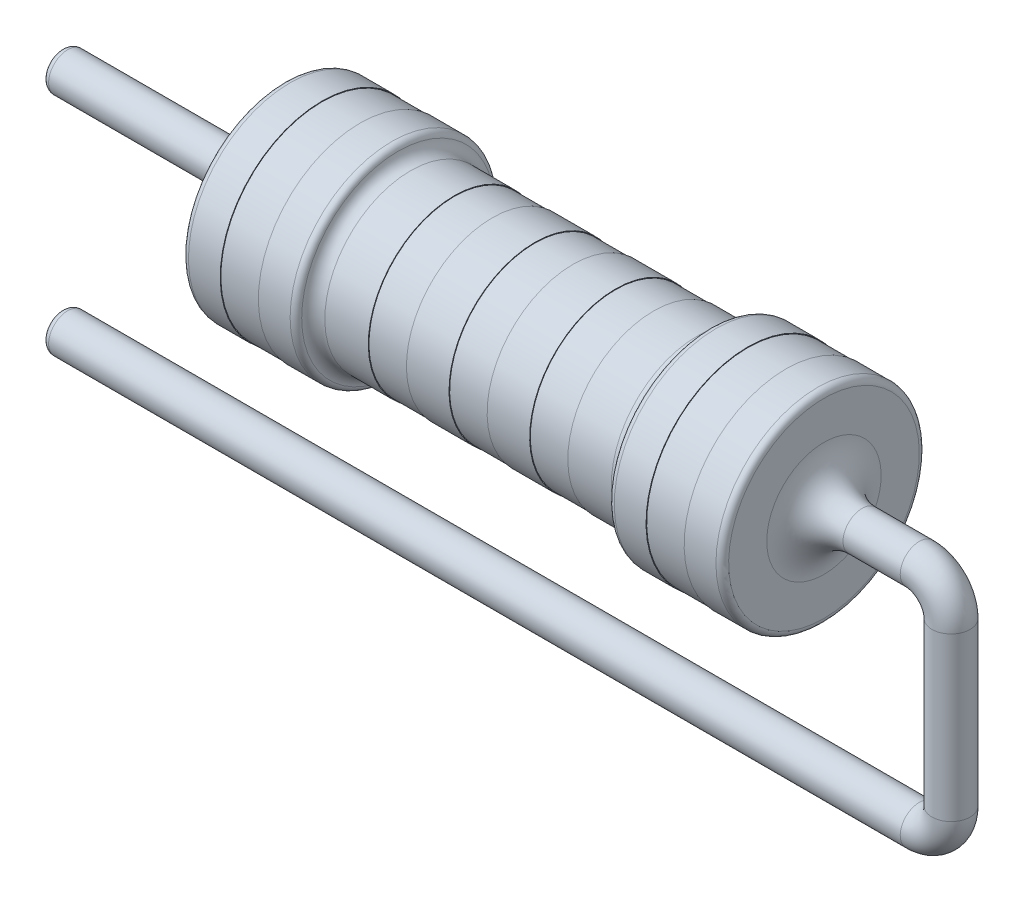
ISO-10303-21;
HEADER;
FILE_DESCRIPTION(('STEP AP214'),'2;1');
FILE_NAME('part.step','',(''),(''),'','','');
FILE_SCHEMA(('AUTOMOTIVE_DESIGN { 1 0 10303 214 1 1 1 1 }'));
ENDSEC;
DATA;
#1=APPLICATION_CONTEXT('core data for automotive mechanical design processes');
#2=APPLICATION_PROTOCOL_DEFINITION('international standard','automotive_design',2000,#1);
#3=PRODUCT_CONTEXT('',#1,'mechanical');
#4=PRODUCT('Part','Part','',(#3));
#5=PRODUCT_RELATED_PRODUCT_CATEGORY('part','',(#4));
#6=PRODUCT_DEFINITION_FORMATION('','',#4);
#7=PRODUCT_DEFINITION_CONTEXT('part definition',#1,'design');
#8=PRODUCT_DEFINITION('design','',#6,#7);
#9=PRODUCT_DEFINITION_SHAPE('','',#8);
#10=(LENGTH_UNIT() NAMED_UNIT(*) SI_UNIT(.MILLI.,.METRE.));
#11=(NAMED_UNIT(*) PLANE_ANGLE_UNIT() SI_UNIT($,.RADIAN.));
#12=(NAMED_UNIT(*) SI_UNIT($,.STERADIAN.) SOLID_ANGLE_UNIT());
#13=UNCERTAINTY_MEASURE_WITH_UNIT(LENGTH_MEASURE(1.E-05),#10,'distance_accuracy_value','');
#14=(GEOMETRIC_REPRESENTATION_CONTEXT(3) GLOBAL_UNCERTAINTY_ASSIGNED_CONTEXT((#13)) GLOBAL_UNIT_ASSIGNED_CONTEXT((#10,
#11,#12)) REPRESENTATION_CONTEXT('',''));
#15=CARTESIAN_POINT('',(0.,0.,0.));
#16=DIRECTION('',(0.,0.,1.));
#17=DIRECTION('',(1.,0.,0.));
#18=AXIS2_PLACEMENT_3D('',#15,#16,#17);
#19=CARTESIAN_POINT('',(-4.25,0.,0.));
#20=DIRECTION('',(1.,0.,0.));
#21=DIRECTION('',(0.,1.,0.));
#22=AXIS2_PLACEMENT_3D('',#19,#20,#21);
#23=PLANE('',#22);
#24=CARTESIAN_POINT('',(-4.25,0.,0.));
#25=DIRECTION('',(1.,0.,0.));
#26=DIRECTION('',(0.,1.,0.));
#27=AXIS2_PLACEMENT_3D('',#24,#25,#26);
#28=CIRCLE('',#27,0.9);
#29=CARTESIAN_POINT('',(-4.25,0.899999999999981,0.));
#30=VERTEX_POINT('',#29);
#31=EDGE_CURVE('E50',#30,#30,#28,.T.);
#32=ORIENTED_EDGE('',*,*,#31,.T.);
#33=EDGE_LOOP('',(#32));
#34=FACE_BOUND('',#33,.T.);
#35=CARTESIAN_POINT('',(-4.25,0.,0.));
#36=DIRECTION('',(1.,0.,0.));
#37=DIRECTION('',(0.,1.,0.));
#38=AXIS2_PLACEMENT_3D('',#35,#36,#37);
#39=CIRCLE('',#38,1.5);
#40=CARTESIAN_POINT('',(-4.25000000000001,1.49999999999994,0.));
#41=VERTEX_POINT('',#40);
#42=EDGE_CURVE('E94',#41,#41,#39,.F.);
#43=ORIENTED_EDGE('',*,*,#42,.T.);
#44=EDGE_LOOP('',(#43));
#45=FACE_BOUND('',#44,.T.);
#46=ADVANCED_FACE('F36',(#34,#45),#23,.F.);
#47=CARTESIAN_POINT('',(4.25,0.,0.));
#48=DIRECTION('',(-1.,0.,0.));
#49=DIRECTION('',(0.,-1.,0.));
#50=AXIS2_PLACEMENT_3D('',#47,#48,#49);
#51=PLANE('',#50);
#52=CARTESIAN_POINT('',(4.25,0.,0.));
#53=DIRECTION('',(-1.,0.,0.));
#54=DIRECTION('',(0.,-1.,0.));
#55=AXIS2_PLACEMENT_3D('',#52,#53,#54);
#56=CIRCLE('',#55,0.9);
#57=CARTESIAN_POINT('',(4.25,-0.899999999999984,0.));
#58=VERTEX_POINT('',#57);
#59=EDGE_CURVE('E10',#58,#58,#56,.T.);
#60=ORIENTED_EDGE('',*,*,#59,.T.);
#61=EDGE_LOOP('',(#60));
#62=FACE_BOUND('',#61,.T.);
#63=CARTESIAN_POINT('',(4.25,0.,0.));
#64=DIRECTION('',(-1.,0.,0.));
#65=DIRECTION('',(0.,-1.,0.));
#66=AXIS2_PLACEMENT_3D('',#63,#64,#65);
#67=CIRCLE('',#66,1.5);
#68=CARTESIAN_POINT('',(4.25000000000001,-1.5,0.));
#69=VERTEX_POINT('',#68);
#70=EDGE_CURVE('E106',#69,#69,#67,.F.);
#71=ORIENTED_EDGE('',*,*,#70,.T.);
#72=EDGE_LOOP('',(#71));
#73=FACE_BOUND('',#72,.T.);
#74=ADVANCED_FACE('F230',(#62,#73),#51,.F.);
#75=CARTESIAN_POINT('',(4.25,0.,0.));
#76=DIRECTION('',(1.,0.,0.));
#77=DIRECTION('',(0.,1.,0.));
#78=AXIS2_PLACEMENT_3D('',#75,#76,#77);
#79=CYLINDRICAL_SURFACE('',#78,1.33999999999997);
#80=CARTESIAN_POINT('',(0.299999999999991,0.,0.));
#81=DIRECTION('',(1.,0.,0.));
#82=DIRECTION('',(0.,1.,0.));
#83=AXIS2_PLACEMENT_3D('',#80,#81,#82);
#84=CIRCLE('',#83,1.33999999999997);
#85=CARTESIAN_POINT('',(0.299999999999982,1.33999999999995,0.));
#86=VERTEX_POINT('',#85);
#87=EDGE_CURVE('E193',#86,#86,#84,.T.);
#88=ORIENTED_EDGE('',*,*,#87,.F.);
#89=EDGE_LOOP('',(#88));
#90=FACE_BOUND('',#89,.T.);
#91=CARTESIAN_POINT('',(-0.299999999999991,0.,0.));
#92=DIRECTION('',(1.,0.,0.));
#93=DIRECTION('',(0.,1.,0.));
#94=AXIS2_PLACEMENT_3D('',#91,#92,#93);
#95=CIRCLE('',#94,1.33999999999997);
#96=CARTESIAN_POINT('',(-0.3,1.33999999999994,0.));
#97=VERTEX_POINT('',#96);
#98=EDGE_CURVE('E118',#97,#97,#95,.T.);
#99=ORIENTED_EDGE('',*,*,#98,.T.);
#100=EDGE_LOOP('',(#99));
#101=FACE_BOUND('',#100,.T.);
#102=ADVANCED_FACE('F236',(#90,#101),#79,.T.);
#103=CARTESIAN_POINT('',(-0.299999999999982,-1.34,0.));
#104=DIRECTION('',(-1.,0.,0.));
#105=DIRECTION('',(0.,-1.,0.));
#106=AXIS2_PLACEMENT_3D('',#103,#104,#105);
#107=PLANE('',#106);
#108=ORIENTED_EDGE('',*,*,#98,.F.);
#109=EDGE_LOOP('',(#108));
#110=FACE_BOUND('',#109,.T.);
#111=CARTESIAN_POINT('',(-0.299999999999991,0.,0.));
#112=DIRECTION('',(1.,0.,0.));
#113=DIRECTION('',(0.,1.,0.));
#114=AXIS2_PLACEMENT_3D('',#111,#112,#113);
#115=CIRCLE('',#114,1.34999999999997);
#116=CARTESIAN_POINT('',(-0.3,1.34999999999994,0.));
#117=VERTEX_POINT('',#116);
#118=EDGE_CURVE('E122',#117,#117,#115,.T.);
#119=ORIENTED_EDGE('',*,*,#118,.T.);
#120=EDGE_LOOP('',(#119));
#121=FACE_BOUND('',#120,.T.);
#122=ADVANCED_FACE('F281',(#110,#121),#107,.F.);
#123=CARTESIAN_POINT('',(4.25,0.,0.));
#124=DIRECTION('',(1.,0.,0.));
#125=DIRECTION('',(0.,1.,0.));
#126=AXIS2_PLACEMENT_3D('',#123,#124,#125);
#127=CYLINDRICAL_SURFACE('',#126,1.34999999999998);
#128=ORIENTED_EDGE('',*,*,#118,.F.);
#129=EDGE_LOOP('',(#128));
#130=FACE_BOUND('',#129,.T.);
#131=CARTESIAN_POINT('',(-0.969520407326291,0.,0.));
#132=DIRECTION('',(1.,0.,0.));
#133=DIRECTION('',(0.,1.,0.));
#134=AXIS2_PLACEMENT_3D('',#131,#132,#133);
#135=CIRCLE('',#134,1.34999999999998);
#136=CARTESIAN_POINT('',(-0.9695204073263,1.34999999999994,0.));
#137=VERTEX_POINT('',#136);
#138=EDGE_CURVE('E126',#137,#137,#135,.T.);
#139=ORIENTED_EDGE('',*,*,#138,.T.);
#140=EDGE_LOOP('',(#139));
#141=FACE_BOUND('',#140,.T.);
#142=ADVANCED_FACE('F277',(#130,#141),#127,.T.);
#143=CARTESIAN_POINT('',(-0.969520407326283,-1.34000000000001,0.));
#144=DIRECTION('',(1.,0.,0.));
#145=DIRECTION('',(0.,1.,0.));
#146=AXIS2_PLACEMENT_3D('',#143,#144,#145);
#147=PLANE('',#146);
#148=ORIENTED_EDGE('',*,*,#138,.F.);
#149=EDGE_LOOP('',(#148));
#150=FACE_BOUND('',#149,.T.);
#151=CARTESIAN_POINT('',(-0.969520407326291,0.,0.));
#152=DIRECTION('',(1.,0.,0.));
#153=DIRECTION('',(0.,1.,0.));
#154=AXIS2_PLACEMENT_3D('',#151,#152,#153);
#155=CIRCLE('',#154,1.33999999999998);
#156=CARTESIAN_POINT('',(-0.9695204073263,1.33999999999994,0.));
#157=VERTEX_POINT('',#156);
#158=EDGE_CURVE('E130',#157,#157,#155,.T.);
#159=ORIENTED_EDGE('',*,*,#158,.T.);
#160=EDGE_LOOP('',(#159));
#161=FACE_BOUND('',#160,.T.);
#162=ADVANCED_FACE('F273',(#150,#161),#147,.F.);
#163=CARTESIAN_POINT('',(4.25,0.,0.));
#164=DIRECTION('',(1.,0.,0.));
#165=DIRECTION('',(0.,1.,0.));
#166=AXIS2_PLACEMENT_3D('',#163,#164,#165);
#167=CYLINDRICAL_SURFACE('',#166,1.33999999999998);
#168=ORIENTED_EDGE('',*,*,#158,.F.);
#169=EDGE_LOOP('',(#168));
#170=FACE_BOUND('',#169,.T.);
#171=CARTESIAN_POINT('',(-1.56952040732629,0.,0.));
#172=DIRECTION('',(1.,0.,0.));
#173=DIRECTION('',(0.,1.,0.));
#174=AXIS2_PLACEMENT_3D('',#171,#172,#173);
#175=CIRCLE('',#174,1.33999999999998);
#176=CARTESIAN_POINT('',(-1.5695204073263,1.33999999999994,0.));
#177=VERTEX_POINT('',#176);
#178=EDGE_CURVE('E134',#177,#177,#175,.T.);
#179=ORIENTED_EDGE('',*,*,#178,.T.);
#180=EDGE_LOOP('',(#179));
#181=FACE_BOUND('',#180,.T.);
#182=ADVANCED_FACE('F269',(#170,#181),#167,.T.);
#183=CARTESIAN_POINT('',(-1.56952040732628,-1.35000000000002,0.));
#184=DIRECTION('',(-1.,0.,0.));
#185=DIRECTION('',(0.,-1.,0.));
#186=AXIS2_PLACEMENT_3D('',#183,#184,#185);
#187=PLANE('',#186);
#188=ORIENTED_EDGE('',*,*,#178,.F.);
#189=EDGE_LOOP('',(#188));
#190=FACE_BOUND('',#189,.T.);
#191=CARTESIAN_POINT('',(-1.56952040732629,0.,0.));
#192=DIRECTION('',(1.,0.,0.));
#193=DIRECTION('',(0.,1.,0.));
#194=AXIS2_PLACEMENT_3D('',#191,#192,#193);
#195=CIRCLE('',#194,1.34999999999998);
#196=CARTESIAN_POINT('',(-1.5695204073263,1.34999999999994,0.));
#197=VERTEX_POINT('',#196);
#198=EDGE_CURVE('E138',#197,#197,#195,.T.);
#199=ORIENTED_EDGE('',*,*,#198,.T.);
#200=EDGE_LOOP('',(#199));
#201=FACE_BOUND('',#200,.T.);
#202=ADVANCED_FACE('F265',(#190,#201),#187,.F.);
#203=CARTESIAN_POINT('',(4.25,0.,0.));
#204=DIRECTION('',(1.,0.,0.));
#205=DIRECTION('',(0.,1.,0.));
#206=AXIS2_PLACEMENT_3D('',#203,#204,#205);
#207=CYLINDRICAL_SURFACE('',#206,1.34999999999999);
#208=CARTESIAN_POINT('',(-2.25419601084501,0.,0.));
#209=DIRECTION('',(1.,0.,0.));
#210=DIRECTION('',(0.,1.,0.));
#211=AXIS2_PLACEMENT_3D('',#208,#209,#210);
#212=CIRCLE('',#211,1.34999999999999);
#213=CARTESIAN_POINT('',(-2.25419601084502,1.34999999999994,0.));
#214=VERTEX_POINT('',#213);
#215=EDGE_CURVE('E82',#214,#214,#212,.T.);
#216=ORIENTED_EDGE('',*,*,#215,.T.);
#217=EDGE_LOOP('',(#216));
#218=FACE_BOUND('',#217,.T.);
#219=ORIENTED_EDGE('',*,*,#198,.F.);
#220=EDGE_LOOP('',(#219));
#221=FACE_BOUND('',#220,.T.);
#222=ADVANCED_FACE('F261',(#218,#221),#207,.T.);
#223=CARTESIAN_POINT('',(4.25,0.,0.));
#224=DIRECTION('',(1.,0.,0.));
#225=DIRECTION('',(0.,1.,0.));
#226=AXIS2_PLACEMENT_3D('',#223,#224,#225);
#227=CYLINDRICAL_SURFACE('',#226,1.59999999999999);
#228=CARTESIAN_POINT('',(-2.54999999999999,0.,0.));
#229=DIRECTION('',(-1.,0.,0.));
#230=DIRECTION('',(0.,-1.,0.));
#231=AXIS2_PLACEMENT_3D('',#228,#229,#230);
#232=CIRCLE('',#231,1.59999999999999);
#233=CARTESIAN_POINT('',(-2.54999999999998,-1.60000000000003,0.));
#234=VERTEX_POINT('',#233);
#235=EDGE_CURVE('E110',#234,#234,#232,.T.);
#236=ORIENTED_EDGE('',*,*,#235,.T.);
#237=EDGE_LOOP('',(#236));
#238=FACE_BOUND('',#237,.T.);
#239=CARTESIAN_POINT('',(-3.04999999999999,0.,0.));
#240=DIRECTION('',(1.,0.,0.));
#241=DIRECTION('',(0.,1.,0.));
#242=AXIS2_PLACEMENT_3D('',#239,#240,#241);
#243=CIRCLE('',#242,1.59999999999999);
#244=CARTESIAN_POINT('',(-3.05,1.59999999999994,0.));
#245=VERTEX_POINT('',#244);
#246=EDGE_CURVE('E142',#245,#245,#243,.T.);
#247=ORIENTED_EDGE('',*,*,#246,.T.);
#248=EDGE_LOOP('',(#247));
#249=FACE_BOUND('',#248,.T.);
#250=ADVANCED_FACE('F257',(#238,#249),#227,.T.);
#251=CARTESIAN_POINT('',(-3.04999999999998,-1.59000000000004,0.));
#252=DIRECTION('',(1.,0.,0.));
#253=DIRECTION('',(0.,1.,0.));
#254=AXIS2_PLACEMENT_3D('',#251,#252,#253);
#255=PLANE('',#254);
#256=ORIENTED_EDGE('',*,*,#246,.F.);
#257=EDGE_LOOP('',(#256));
#258=FACE_BOUND('',#257,.T.);
#259=CARTESIAN_POINT('',(-3.04999999999999,0.,0.));
#260=DIRECTION('',(1.,0.,0.));
#261=DIRECTION('',(0.,1.,0.));
#262=AXIS2_PLACEMENT_3D('',#259,#260,#261);
#263=CIRCLE('',#262,1.58999999999999);
#264=CARTESIAN_POINT('',(-3.05,1.58999999999994,0.));
#265=VERTEX_POINT('',#264);
#266=EDGE_CURVE('E146',#265,#265,#263,.T.);
#267=ORIENTED_EDGE('',*,*,#266,.T.);
#268=EDGE_LOOP('',(#267));
#269=FACE_BOUND('',#268,.T.);
#270=ADVANCED_FACE('F253',(#258,#269),#255,.F.);
#271=CARTESIAN_POINT('',(4.25,0.,0.));
#272=DIRECTION('',(1.,0.,0.));
#273=DIRECTION('',(0.,1.,0.));
#274=AXIS2_PLACEMENT_3D('',#271,#272,#273);
#275=CYLINDRICAL_SURFACE('',#274,1.58999999999999);
#276=ORIENTED_EDGE('',*,*,#266,.F.);
#277=EDGE_LOOP('',(#276));
#278=FACE_BOUND('',#277,.T.);
#279=CARTESIAN_POINT('',(-3.64999999999999,0.,0.));
#280=DIRECTION('',(1.,0.,0.));
#281=DIRECTION('',(0.,1.,0.));
#282=AXIS2_PLACEMENT_3D('',#279,#280,#281);
#283=CIRCLE('',#282,1.59);
#284=CARTESIAN_POINT('',(-3.65,1.58999999999994,0.));
#285=VERTEX_POINT('',#284);
#286=EDGE_CURVE('E150',#285,#285,#283,.T.);
#287=ORIENTED_EDGE('',*,*,#286,.T.);
#288=EDGE_LOOP('',(#287));
#289=FACE_BOUND('',#288,.T.);
#290=ADVANCED_FACE('F249',(#278,#289),#275,.T.);
#291=CARTESIAN_POINT('',(-3.64999999999998,-1.60000000000005,0.));
#292=DIRECTION('',(-1.,0.,0.));
#293=DIRECTION('',(0.,-1.,0.));
#294=AXIS2_PLACEMENT_3D('',#291,#292,#293);
#295=PLANE('',#294);
#296=ORIENTED_EDGE('',*,*,#286,.F.);
#297=EDGE_LOOP('',(#296));
#298=FACE_BOUND('',#297,.T.);
#299=CARTESIAN_POINT('',(-3.64999999999999,0.,0.));
#300=DIRECTION('',(1.,0.,0.));
#301=DIRECTION('',(0.,1.,0.));
#302=AXIS2_PLACEMENT_3D('',#299,#300,#301);
#303=CIRCLE('',#302,1.6);
#304=CARTESIAN_POINT('',(-3.65,1.59999999999994,0.));
#305=VERTEX_POINT('',#304);
#306=EDGE_CURVE('E154',#305,#305,#303,.T.);
#307=ORIENTED_EDGE('',*,*,#306,.T.);
#308=EDGE_LOOP('',(#307));
#309=FACE_BOUND('',#308,.T.);
#310=ADVANCED_FACE('F245',(#298,#309),#295,.F.);
#311=CARTESIAN_POINT('',(4.25,0.,0.));
#312=DIRECTION('',(1.,0.,0.));
#313=DIRECTION('',(0.,1.,0.));
#314=AXIS2_PLACEMENT_3D('',#311,#312,#313);
#315=CYLINDRICAL_SURFACE('',#314,1.6);
#316=CARTESIAN_POINT('',(-4.15,0.,0.));
#317=DIRECTION('',(1.,0.,0.));
#318=DIRECTION('',(0.,1.,0.));
#319=AXIS2_PLACEMENT_3D('',#316,#317,#318);
#320=CIRCLE('',#319,1.6);
#321=CARTESIAN_POINT('',(-4.15000000000001,1.59999999999994,0.));
#322=VERTEX_POINT('',#321);
#323=EDGE_CURVE('E98',#322,#322,#320,.T.);
#324=ORIENTED_EDGE('',*,*,#323,.T.);
#325=EDGE_LOOP('',(#324));
#326=FACE_BOUND('',#325,.T.);
#327=ORIENTED_EDGE('',*,*,#306,.F.);
#328=EDGE_LOOP('',(#327));
#329=FACE_BOUND('',#328,.T.);
#330=ADVANCED_FACE('F241',(#326,#329),#315,.T.);
#331=CARTESIAN_POINT('',(4.25,0.,0.));
#332=DIRECTION('',(1.,0.,0.));
#333=DIRECTION('',(0.,1.,0.));
#334=AXIS2_PLACEMENT_3D('',#331,#332,#333);
#335=CYLINDRICAL_SURFACE('',#334,1.6);
#336=CARTESIAN_POINT('',(4.15,0.,0.));
#337=DIRECTION('',(-1.,0.,0.));
#338=DIRECTION('',(0.,-1.,0.));
#339=AXIS2_PLACEMENT_3D('',#336,#337,#338);
#340=CIRCLE('',#339,1.6);
#341=CARTESIAN_POINT('',(4.15000000000001,-1.6,0.));
#342=VERTEX_POINT('',#341);
#343=EDGE_CURVE('E102',#342,#342,#340,.T.);
#344=ORIENTED_EDGE('',*,*,#343,.T.);
#345=EDGE_LOOP('',(#344));
#346=FACE_BOUND('',#345,.T.);
#347=CARTESIAN_POINT('',(3.64999999999999,0.,0.));
#348=DIRECTION('',(1.,0.,0.));
#349=DIRECTION('',(0.,1.,0.));
#350=AXIS2_PLACEMENT_3D('',#347,#348,#349);
#351=CIRCLE('',#350,1.6);
#352=CARTESIAN_POINT('',(3.64999999999998,1.59999999999999,0.));
#353=VERTEX_POINT('',#352);
#354=EDGE_CURVE('E158',#353,#353,#351,.T.);
#355=ORIENTED_EDGE('',*,*,#354,.T.);
#356=EDGE_LOOP('',(#355));
#357=FACE_BOUND('',#356,.T.);
#358=ADVANCED_FACE('F244',(#346,#357),#335,.T.);
#359=CARTESIAN_POINT('',(3.65,-1.6,0.));
#360=DIRECTION('',(1.,0.,0.));
#361=DIRECTION('',(0.,1.,0.));
#362=AXIS2_PLACEMENT_3D('',#359,#360,#361);
#363=PLANE('',#362);
#364=ORIENTED_EDGE('',*,*,#354,.F.);
#365=EDGE_LOOP('',(#364));
#366=FACE_BOUND('',#365,.T.);
#367=CARTESIAN_POINT('',(3.64999999999999,0.,0.));
#368=DIRECTION('',(1.,0.,0.));
#369=DIRECTION('',(0.,1.,0.));
#370=AXIS2_PLACEMENT_3D('',#367,#368,#369);
#371=CIRCLE('',#370,1.59);
#372=CARTESIAN_POINT('',(3.64999999999998,1.58999999999999,0.));
#373=VERTEX_POINT('',#372);
#374=EDGE_CURVE('E162',#373,#373,#371,.T.);
#375=ORIENTED_EDGE('',*,*,#374,.T.);
#376=EDGE_LOOP('',(#375));
#377=FACE_BOUND('',#376,.T.);
#378=ADVANCED_FACE('F570',(#366,#377),#363,.F.);
#379=CARTESIAN_POINT('',(4.25,0.,0.));
#380=DIRECTION('',(1.,0.,0.));
#381=DIRECTION('',(0.,1.,0.));
#382=AXIS2_PLACEMENT_3D('',#379,#380,#381);
#383=CYLINDRICAL_SURFACE('',#382,1.58999999999999);
#384=ORIENTED_EDGE('',*,*,#374,.F.);
#385=EDGE_LOOP('',(#384));
#386=FACE_BOUND('',#385,.T.);
#387=CARTESIAN_POINT('',(3.04999999999999,0.,0.));
#388=DIRECTION('',(1.,0.,0.));
#389=DIRECTION('',(0.,1.,0.));
#390=AXIS2_PLACEMENT_3D('',#387,#388,#389);
#391=CIRCLE('',#390,1.58999999999999);
#392=CARTESIAN_POINT('',(3.04999999999998,1.58999999999998,0.));
#393=VERTEX_POINT('',#392);
#394=EDGE_CURVE('E166',#393,#393,#391,.T.);
#395=ORIENTED_EDGE('',*,*,#394,.T.);
#396=EDGE_LOOP('',(#395));
#397=FACE_BOUND('',#396,.T.);
#398=ADVANCED_FACE('F560',(#386,#397),#383,.T.);
#399=CARTESIAN_POINT('',(3.05,-1.59,0.));
#400=DIRECTION('',(-1.,0.,0.));
#401=DIRECTION('',(0.,-1.,0.));
#402=AXIS2_PLACEMENT_3D('',#399,#400,#401);
#403=PLANE('',#402);
#404=ORIENTED_EDGE('',*,*,#394,.F.);
#405=EDGE_LOOP('',(#404));
#406=FACE_BOUND('',#405,.T.);
#407=CARTESIAN_POINT('',(3.04999999999999,0.,0.));
#408=DIRECTION('',(1.,0.,0.));
#409=DIRECTION('',(0.,1.,0.));
#410=AXIS2_PLACEMENT_3D('',#407,#408,#409);
#411=CIRCLE('',#410,1.59999999999999);
#412=CARTESIAN_POINT('',(3.04999999999998,1.59999999999999,0.));
#413=VERTEX_POINT('',#412);
#414=EDGE_CURVE('E170',#413,#413,#411,.T.);
#415=ORIENTED_EDGE('',*,*,#414,.T.);
#416=EDGE_LOOP('',(#415));
#417=FACE_BOUND('',#416,.T.);
#418=ADVANCED_FACE('F550',(#406,#417),#403,.F.);
#419=CARTESIAN_POINT('',(4.25,0.,0.));
#420=DIRECTION('',(1.,0.,0.));
#421=DIRECTION('',(0.,1.,0.));
#422=AXIS2_PLACEMENT_3D('',#419,#420,#421);
#423=CYLINDRICAL_SURFACE('',#422,1.59999999999999);
#424=CARTESIAN_POINT('',(2.54999999999999,0.,0.));
#425=DIRECTION('',(1.,0.,0.));
#426=DIRECTION('',(0.,1.,0.));
#427=AXIS2_PLACEMENT_3D('',#424,#425,#426);
#428=CIRCLE('',#427,1.59999999999999);
#429=CARTESIAN_POINT('',(2.54999999999998,1.59999999999998,0.));
#430=VERTEX_POINT('',#429);
#431=EDGE_CURVE('E114',#430,#430,#428,.T.);
#432=ORIENTED_EDGE('',*,*,#431,.T.);
#433=EDGE_LOOP('',(#432));
#434=FACE_BOUND('',#433,.T.);
#435=ORIENTED_EDGE('',*,*,#414,.F.);
#436=EDGE_LOOP('',(#435));
#437=FACE_BOUND('',#436,.T.);
#438=ADVANCED_FACE('F541',(#434,#437),#423,.T.);
#439=CARTESIAN_POINT('',(4.25,0.,0.));
#440=DIRECTION('',(1.,0.,0.));
#441=DIRECTION('',(0.,1.,0.));
#442=AXIS2_PLACEMENT_3D('',#439,#440,#441);
#443=CYLINDRICAL_SURFACE('',#442,1.34999999999999);
#444=CARTESIAN_POINT('',(2.25419601084501,0.,0.));
#445=DIRECTION('',(1.,0.,0.));
#446=DIRECTION('',(0.,1.,0.));
#447=AXIS2_PLACEMENT_3D('',#444,#445,#446);
#448=CIRCLE('',#447,1.34999999999999);
#449=CARTESIAN_POINT('',(2.254196010845,1.34999999999997,0.));
#450=VERTEX_POINT('',#449);
#451=EDGE_CURVE('E86',#450,#450,#448,.F.);
#452=ORIENTED_EDGE('',*,*,#451,.T.);
#453=EDGE_LOOP('',(#452));
#454=FACE_BOUND('',#453,.T.);
#455=CARTESIAN_POINT('',(1.56952040732629,0.,0.));
#456=DIRECTION('',(1.,0.,0.));
#457=DIRECTION('',(0.,1.,0.));
#458=AXIS2_PLACEMENT_3D('',#455,#456,#457);
#459=CIRCLE('',#458,1.34999999999998);
#460=CARTESIAN_POINT('',(1.56952040732628,1.34999999999997,0.));
#461=VERTEX_POINT('',#460);
#462=EDGE_CURVE('E174',#461,#461,#459,.T.);
#463=ORIENTED_EDGE('',*,*,#462,.T.);
#464=EDGE_LOOP('',(#463));
#465=FACE_BOUND('',#464,.T.);
#466=ADVANCED_FACE('F531',(#454,#465),#443,.T.);
#467=CARTESIAN_POINT('',(1.5695204073263,-1.35,0.));
#468=DIRECTION('',(1.,0.,0.));
#469=DIRECTION('',(0.,1.,0.));
#470=AXIS2_PLACEMENT_3D('',#467,#468,#469);
#471=PLANE('',#470);
#472=ORIENTED_EDGE('',*,*,#462,.F.);
#473=EDGE_LOOP('',(#472));
#474=FACE_BOUND('',#473,.T.);
#475=CARTESIAN_POINT('',(1.56952040732629,0.,0.));
#476=DIRECTION('',(1.,0.,0.));
#477=DIRECTION('',(0.,1.,0.));
#478=AXIS2_PLACEMENT_3D('',#475,#476,#477);
#479=CIRCLE('',#478,1.33999999999998);
#480=CARTESIAN_POINT('',(1.56952040732628,1.33999999999996,0.));
#481=VERTEX_POINT('',#480);
#482=EDGE_CURVE('E178',#481,#481,#479,.T.);
#483=ORIENTED_EDGE('',*,*,#482,.T.);
#484=EDGE_LOOP('',(#483));
#485=FACE_BOUND('',#484,.T.);
#486=ADVANCED_FACE('F521',(#474,#485),#471,.F.);
#487=CARTESIAN_POINT('',(4.25,0.,0.));
#488=DIRECTION('',(1.,0.,0.));
#489=DIRECTION('',(0.,1.,0.));
#490=AXIS2_PLACEMENT_3D('',#487,#488,#489);
#491=CYLINDRICAL_SURFACE('',#490,1.33999999999998);
#492=ORIENTED_EDGE('',*,*,#482,.F.);
#493=EDGE_LOOP('',(#492));
#494=FACE_BOUND('',#493,.T.);
#495=CARTESIAN_POINT('',(0.969520407326292,0.,0.));
#496=DIRECTION('',(1.,0.,0.));
#497=DIRECTION('',(0.,1.,0.));
#498=AXIS2_PLACEMENT_3D('',#495,#496,#497);
#499=CIRCLE('',#498,1.33999999999998);
#500=CARTESIAN_POINT('',(0.969520407326283,1.33999999999996,0.));
#501=VERTEX_POINT('',#500);
#502=EDGE_CURVE('E182',#501,#501,#499,.T.);
#503=ORIENTED_EDGE('',*,*,#502,.T.);
#504=EDGE_LOOP('',(#503));
#505=FACE_BOUND('',#504,.T.);
#506=ADVANCED_FACE('F511',(#494,#505),#491,.T.);
#507=CARTESIAN_POINT('',(0.969520407326301,-1.34,0.));
#508=DIRECTION('',(-1.,0.,0.));
#509=DIRECTION('',(0.,-1.,0.));
#510=AXIS2_PLACEMENT_3D('',#507,#508,#509);
#511=PLANE('',#510);
#512=ORIENTED_EDGE('',*,*,#502,.F.);
#513=EDGE_LOOP('',(#512));
#514=FACE_BOUND('',#513,.T.);
#515=CARTESIAN_POINT('',(0.969520407326291,0.,0.));
#516=DIRECTION('',(1.,0.,0.));
#517=DIRECTION('',(0.,1.,0.));
#518=AXIS2_PLACEMENT_3D('',#515,#516,#517);
#519=CIRCLE('',#518,1.34999999999998);
#520=CARTESIAN_POINT('',(0.969520407326283,1.34999999999996,0.));
#521=VERTEX_POINT('',#520);
#522=EDGE_CURVE('E186',#521,#521,#519,.T.);
#523=ORIENTED_EDGE('',*,*,#522,.T.);
#524=EDGE_LOOP('',(#523));
#525=FACE_BOUND('',#524,.T.);
#526=ADVANCED_FACE('F501',(#514,#525),#511,.F.);
#527=CARTESIAN_POINT('',(4.25,0.,0.));
#528=DIRECTION('',(1.,0.,0.));
#529=DIRECTION('',(0.,1.,0.));
#530=AXIS2_PLACEMENT_3D('',#527,#528,#529);
#531=CYLINDRICAL_SURFACE('',#530,1.34999999999998);
#532=ORIENTED_EDGE('',*,*,#522,.F.);
#533=EDGE_LOOP('',(#532));
#534=FACE_BOUND('',#533,.T.);
#535=CARTESIAN_POINT('',(0.299999999999991,0.,0.));
#536=DIRECTION('',(1.,0.,0.));
#537=DIRECTION('',(0.,1.,0.));
#538=AXIS2_PLACEMENT_3D('',#535,#536,#537);
#539=CIRCLE('',#538,1.34999999999997);
#540=CARTESIAN_POINT('',(0.299999999999982,1.34999999999995,0.));
#541=VERTEX_POINT('',#540);
#542=EDGE_CURVE('E189',#541,#541,#539,.T.);
#543=ORIENTED_EDGE('',*,*,#542,.T.);
#544=EDGE_LOOP('',(#543));
#545=FACE_BOUND('',#544,.T.);
#546=ADVANCED_FACE('F490',(#534,#545),#531,.T.);
#547=CARTESIAN_POINT('',(0.3,-1.34,0.));
#548=DIRECTION('',(1.,0.,0.));
#549=DIRECTION('',(0.,1.,0.));
#550=AXIS2_PLACEMENT_3D('',#547,#548,#549);
#551=PLANE('',#550);
#552=ORIENTED_EDGE('',*,*,#542,.F.);
#553=EDGE_LOOP('',(#552));
#554=FACE_BOUND('',#553,.T.);
#555=ORIENTED_EDGE('',*,*,#87,.T.);
#556=EDGE_LOOP('',(#555));
#557=FACE_BOUND('',#556,.T.);
#558=ADVANCED_FACE('F293',(#554,#557),#551,.F.);
#559=CARTESIAN_POINT('',(2.54999999999999,0.,0.));
#560=DIRECTION('',(1.,0.,0.));
#561=DIRECTION('',(0.,1.,0.));
#562=AXIS2_PLACEMENT_3D('',#559,#560,#561);
#563=TOROIDAL_SURFACE('',#562,1.49999999999999,0.1);
#564=CARTESIAN_POINT('',(2.45139867028172,0.,0.));
#565=DIRECTION('',(1.,0.,0.));
#566=DIRECTION('',(0.,1.,0.));
#567=AXIS2_PLACEMENT_3D('',#564,#565,#566);
#568=CIRCLE('',#567,1.51666666666665);
#569=CARTESIAN_POINT('',(2.45139867028171,1.51666666666663,0.));
#570=VERTEX_POINT('',#569);
#571=EDGE_CURVE('E90',#570,#570,#568,.T.);
#572=ORIENTED_EDGE('',*,*,#571,.T.);
#573=EDGE_LOOP('',(#572));
#574=FACE_BOUND('',#573,.T.);
#575=ORIENTED_EDGE('',*,*,#431,.F.);
#576=EDGE_LOOP('',(#575));
#577=FACE_BOUND('',#576,.T.);
#578=ADVANCED_FACE('F289',(#574,#577),#563,.T.);
#579=CARTESIAN_POINT('',(-2.54999999999999,0.,0.));
#580=DIRECTION('',(-1.,0.,0.));
#581=DIRECTION('',(0.,-1.,0.));
#582=AXIS2_PLACEMENT_3D('',#579,#580,#581);
#583=TOROIDAL_SURFACE('',#582,1.49999999999999,0.1);
#584=CARTESIAN_POINT('',(-2.4513986702818,0.,0.));
#585=DIRECTION('',(-1.,0.,0.));
#586=DIRECTION('',(0.,-1.,0.));
#587=AXIS2_PLACEMENT_3D('',#584,#585,#586);
#588=CIRCLE('',#587,1.51666666666663);
#589=CARTESIAN_POINT('',(-2.45139867028179,-1.51666666666668,0.));
#590=VERTEX_POINT('',#589);
#591=EDGE_CURVE('E78',#590,#590,#588,.T.);
#592=ORIENTED_EDGE('',*,*,#591,.T.);
#593=EDGE_LOOP('',(#592));
#594=FACE_BOUND('',#593,.T.);
#595=ORIENTED_EDGE('',*,*,#235,.F.);
#596=EDGE_LOOP('',(#595));
#597=FACE_BOUND('',#596,.T.);
#598=ADVANCED_FACE('F292',(#594,#597),#583,.T.);
#599=CARTESIAN_POINT('',(4.15,0.,0.));
#600=DIRECTION('',(-1.,0.,0.));
#601=DIRECTION('',(0.,-1.,0.));
#602=AXIS2_PLACEMENT_3D('',#599,#600,#601);
#603=TOROIDAL_SURFACE('',#602,1.5,0.1);
#604=ORIENTED_EDGE('',*,*,#343,.F.);
#605=EDGE_LOOP('',(#604));
#606=FACE_BOUND('',#605,.T.);
#607=ORIENTED_EDGE('',*,*,#70,.F.);
#608=EDGE_LOOP('',(#607));
#609=FACE_BOUND('',#608,.T.);
#610=ADVANCED_FACE('F297',(#606,#609),#603,.T.);
#611=CARTESIAN_POINT('',(-4.15,0.,0.));
#612=DIRECTION('',(1.,0.,0.));
#613=DIRECTION('',(0.,1.,0.));
#614=AXIS2_PLACEMENT_3D('',#611,#612,#613);
#615=TOROIDAL_SURFACE('',#614,1.5,0.1);
#616=ORIENTED_EDGE('',*,*,#42,.F.);
#617=EDGE_LOOP('',(#616));
#618=FACE_BOUND('',#617,.T.);
#619=ORIENTED_EDGE('',*,*,#323,.F.);
#620=EDGE_LOOP('',(#619));
#621=FACE_BOUND('',#620,.T.);
#622=ADVANCED_FACE('F301',(#618,#621),#615,.T.);
#623=CARTESIAN_POINT('',(2.25419601084501,0.,0.));
#624=DIRECTION('',(1.,0.,0.));
#625=DIRECTION('',(0.,1.,0.));
#626=AXIS2_PLACEMENT_3D('',#623,#624,#625);
#627=TOROIDAL_SURFACE('',#626,1.54999999999999,0.2);
#628=ORIENTED_EDGE('',*,*,#451,.F.);
#629=EDGE_LOOP('',(#628));
#630=FACE_BOUND('',#629,.T.);
#631=ORIENTED_EDGE('',*,*,#571,.F.);
#632=EDGE_LOOP('',(#631));
#633=FACE_BOUND('',#632,.T.);
#634=ADVANCED_FACE('F305',(#630,#633),#627,.F.);
#635=CARTESIAN_POINT('',(-2.25419601084501,0.,0.));
#636=DIRECTION('',(1.,0.,0.));
#637=DIRECTION('',(0.,1.,0.));
#638=AXIS2_PLACEMENT_3D('',#635,#636,#637);
#639=TOROIDAL_SURFACE('',#638,1.54999999999999,0.2);
#640=ORIENTED_EDGE('',*,*,#591,.F.);
#641=EDGE_LOOP('',(#640));
#642=FACE_BOUND('',#641,.T.);
#643=ORIENTED_EDGE('',*,*,#215,.F.);
#644=EDGE_LOOP('',(#643));
#645=FACE_BOUND('',#644,.T.);
#646=ADVANCED_FACE('F309',(#642,#645),#639,.F.);
#647=CARTESIAN_POINT('',(5.75,-3.55666344032292,0.));
#648=DIRECTION('',(-1.,0.,0.));
#649=DIRECTION('',(0.,-1.,0.));
#650=AXIS2_PLACEMENT_3D('',#647,#648,#649);
#651=CYLINDRICAL_SURFACE('',#650,0.3);
#652=CARTESIAN_POINT('',(-7.65000000000001,-3.55666344032292,0.));
#653=DIRECTION('',(-1.,0.,0.));
#654=DIRECTION('',(0.,-1.,0.));
#655=AXIS2_PLACEMENT_3D('',#652,#653,#654);
#656=CIRCLE('',#655,0.3);
#657=CARTESIAN_POINT('',(-7.65,-3.85666344032292,0.));
#658=VERTEX_POINT('',#657);
#659=EDGE_CURVE('E62',#658,#658,#656,.F.);
#660=ORIENTED_EDGE('',*,*,#659,.T.);
#661=EDGE_LOOP('',(#660));
#662=FACE_BOUND('',#661,.T.);
#663=CARTESIAN_POINT('',(5.75,-3.55666344032292,0.));
#664=DIRECTION('',(-1.,0.,0.));
#665=DIRECTION('',(0.,-1.,0.));
#666=AXIS2_PLACEMENT_3D('',#663,#664,#665);
#667=CIRCLE('',#666,0.3);
#668=CARTESIAN_POINT('',(5.74999999999999,-3.85666344032292,0.));
#669=VERTEX_POINT('',#668);
#670=EDGE_CURVE('E197',#669,#669,#667,.T.);
#671=ORIENTED_EDGE('',*,*,#670,.T.);
#672=EDGE_LOOP('',(#671));
#673=FACE_BOUND('',#672,.T.);
#674=ADVANCED_FACE('F313',(#662,#673),#651,.T.);
#675=CARTESIAN_POINT('',(5.75,-3.05666344032292,0.));
#676=DIRECTION('',(0.,0.,-1.));
#677=DIRECTION('',(-1.,0.,0.));
#678=AXIS2_PLACEMENT_3D('',#675,#676,#677);
#679=TOROIDAL_SURFACE('',#678,0.5,0.3);
#680=CARTESIAN_POINT('',(6.25,-3.05666344032292,0.));
#681=DIRECTION('',(0.,-1.,0.));
#682=DIRECTION('',(1.,0.,0.));
#683=AXIS2_PLACEMENT_3D('',#680,#681,#682);
#684=CIRCLE('',#683,0.3);
#685=CARTESIAN_POINT('',(6.55,-3.05666344032293,0.));
#686=VERTEX_POINT('',#685);
#687=EDGE_CURVE('E201',#686,#686,#684,.T.);
#688=CARTESIAN_POINT('',(5.75,-3.05666344032292,0.));
#689=DIRECTION('',(0.,0.,-1.));
#690=DIRECTION('',(-1.,0.,0.));
#691=AXIS2_PLACEMENT_3D('',#688,#689,#690);
#692=CIRCLE('',#691,0.8);
#693=EDGE_CURVE('',#686,#669,#692,.T.);
#694=ORIENTED_EDGE('',*,*,#687,.T.);
#695=ORIENTED_EDGE('',*,*,#670,.F.);
#696=ORIENTED_EDGE('',*,*,#693,.T.);
#697=ORIENTED_EDGE('',*,*,#693,.F.);
#698=EDGE_LOOP('',(#694,#696,#695,#697));
#699=FACE_BOUND('',#698,.T.);
#700=ADVANCED_FACE('F419',(#699),#679,.T.);
#701=CARTESIAN_POINT('',(6.25,-0.499999999999994,0.));
#702=DIRECTION('',(0.,-1.,0.));
#703=DIRECTION('',(0.,0.,-1.));
#704=AXIS2_PLACEMENT_3D('',#701,#702,#703);
#705=CYLINDRICAL_SURFACE('',#704,0.3);
#706=CARTESIAN_POINT('',(6.25,-0.499999999999994,0.));
#707=DIRECTION('',(0.,-1.,0.));
#708=DIRECTION('',(1.,0.,0.));
#709=AXIS2_PLACEMENT_3D('',#706,#707,#708);
#710=CIRCLE('',#709,0.3);
#711=CARTESIAN_POINT('',(6.55,-0.499999999999994,0.));
#712=VERTEX_POINT('',#711);
#713=EDGE_CURVE('E205',#712,#712,#710,.T.);
#714=ORIENTED_EDGE('',*,*,#713,.T.);
#715=EDGE_LOOP('',(#714));
#716=FACE_BOUND('',#715,.T.);
#717=ORIENTED_EDGE('',*,*,#687,.F.);
#718=EDGE_LOOP('',(#717));
#719=FACE_BOUND('',#718,.T.);
#720=ADVANCED_FACE('F227',(#716,#719),#705,.T.);
#721=CARTESIAN_POINT('',(5.75,-0.499999999999993,0.));
#722=DIRECTION('',(0.,0.,-1.));
#723=DIRECTION('',(-1.,0.,0.));
#724=AXIS2_PLACEMENT_3D('',#721,#722,#723);
#725=TOROIDAL_SURFACE('',#724,0.5,0.3);
#726=CARTESIAN_POINT('',(5.75,0.,0.));
#727=DIRECTION('',(1.,0.,0.));
#728=DIRECTION('',(0.,1.,0.));
#729=AXIS2_PLACEMENT_3D('',#726,#727,#728);
#730=CIRCLE('',#729,0.3);
#731=CARTESIAN_POINT('',(5.75000000000001,0.300000000000007,0.));
#732=VERTEX_POINT('',#731);
#733=EDGE_CURVE('E208',#732,#732,#730,.T.);
#734=CARTESIAN_POINT('',(5.75,-0.499999999999993,0.));
#735=DIRECTION('',(0.,0.,-1.));
#736=DIRECTION('',(-1.,0.,0.));
#737=AXIS2_PLACEMENT_3D('',#734,#735,#736);
#738=CIRCLE('',#737,0.8);
#739=EDGE_CURVE('',#732,#712,#738,.T.);
#740=ORIENTED_EDGE('',*,*,#733,.T.);
#741=ORIENTED_EDGE('',*,*,#713,.F.);
#742=ORIENTED_EDGE('',*,*,#739,.T.);
#743=ORIENTED_EDGE('',*,*,#739,.F.);
#744=EDGE_LOOP('',(#740,#742,#741,#743));
#745=FACE_BOUND('',#744,.T.);
#746=ADVANCED_FACE('F213',(#745),#725,.T.);
#747=CARTESIAN_POINT('',(5.75,0.,0.));
#748=DIRECTION('',(-1.,0.,0.));
#749=DIRECTION('',(0.,-1.,0.));
#750=AXIS2_PLACEMENT_3D('',#747,#748,#749);
#751=CYLINDRICAL_SURFACE('',#750,0.3);
#752=CARTESIAN_POINT('',(4.84999999999998,0.,0.));
#753=DIRECTION('',(-1.,0.,0.));
#754=DIRECTION('',(0.,-1.,0.));
#755=AXIS2_PLACEMENT_3D('',#752,#753,#754);
#756=CIRCLE('',#755,0.3);
#757=CARTESIAN_POINT('',(4.84999999999999,-0.29999999999998,0.));
#758=VERTEX_POINT('',#757);
#759=EDGE_CURVE('E44',#758,#758,#756,.F.);
#760=ORIENTED_EDGE('',*,*,#759,.T.);
#761=EDGE_LOOP('',(#760));
#762=FACE_BOUND('',#761,.T.);
#763=ORIENTED_EDGE('',*,*,#733,.F.);
#764=EDGE_LOOP('',(#763));
#765=FACE_BOUND('',#764,.T.);
#766=ADVANCED_FACE('F216',(#762,#765),#751,.T.);
#767=CARTESIAN_POINT('',(-7.75,-3.55666344032292,0.));
#768=DIRECTION('',(-1.,0.,0.));
#769=DIRECTION('',(0.,-1.,0.));
#770=AXIS2_PLACEMENT_3D('',#767,#768,#769);
#771=PLANE('',#770);
#772=CARTESIAN_POINT('',(-7.75,-3.55666344032293,0.));
#773=DIRECTION('',(-1.,0.,0.));
#774=DIRECTION('',(0.,-1.,0.));
#775=AXIS2_PLACEMENT_3D('',#772,#773,#774);
#776=CIRCLE('',#775,0.2);
#777=CARTESIAN_POINT('',(-7.75,-3.75666344032293,0.));
#778=VERTEX_POINT('',#777);
#779=EDGE_CURVE('E66',#778,#778,#776,.T.);
#780=ORIENTED_EDGE('',*,*,#779,.T.);
#781=EDGE_LOOP('',(#780));
#782=FACE_BOUND('',#781,.T.);
#783=ADVANCED_FACE('F218',(#782),#771,.T.);
#784=CARTESIAN_POINT('',(-7.75,0.,0.));
#785=DIRECTION('',(1.,0.,0.));
#786=DIRECTION('',(0.,1.,0.));
#787=AXIS2_PLACEMENT_3D('',#784,#785,#786);
#788=CYLINDRICAL_SURFACE('',#787,0.3);
#789=CARTESIAN_POINT('',(-4.84999999999999,0.,0.));
#790=DIRECTION('',(1.,0.,0.));
#791=DIRECTION('',(0.,1.,0.));
#792=AXIS2_PLACEMENT_3D('',#789,#790,#791);
#793=CIRCLE('',#792,0.3);
#794=CARTESIAN_POINT('',(-4.84999999999999,0.299999999999977,0.));
#795=VERTEX_POINT('',#794);
#796=EDGE_CURVE('E56',#795,#795,#793,.F.);
#797=ORIENTED_EDGE('',*,*,#796,.T.);
#798=EDGE_LOOP('',(#797));
#799=FACE_BOUND('',#798,.T.);
#800=CARTESIAN_POINT('',(-7.65,0.,0.));
#801=DIRECTION('',(-1.,0.,0.));
#802=DIRECTION('',(0.,-1.,0.));
#803=AXIS2_PLACEMENT_3D('',#800,#801,#802);
#804=CIRCLE('',#803,0.3);
#805=CARTESIAN_POINT('',(-7.65,-0.300000000000001,0.));
#806=VERTEX_POINT('',#805);
#807=EDGE_CURVE('E70',#806,#806,#804,.F.);
#808=ORIENTED_EDGE('',*,*,#807,.T.);
#809=EDGE_LOOP('',(#808));
#810=FACE_BOUND('',#809,.T.);
#811=ADVANCED_FACE('F224',(#799,#810),#788,.T.);
#812=CARTESIAN_POINT('',(-7.75,0.,0.));
#813=DIRECTION('',(-1.,0.,0.));
#814=DIRECTION('',(0.,-1.,0.));
#815=AXIS2_PLACEMENT_3D('',#812,#813,#814);
#816=PLANE('',#815);
#817=CARTESIAN_POINT('',(-7.75,0.,0.));
#818=DIRECTION('',(-1.,0.,0.));
#819=DIRECTION('',(0.,-1.,0.));
#820=AXIS2_PLACEMENT_3D('',#817,#818,#819);
#821=CIRCLE('',#820,0.2);
#822=CARTESIAN_POINT('',(-7.74999999999999,-0.200000000000001,0.));
#823=VERTEX_POINT('',#822);
#824=EDGE_CURVE('E74',#823,#823,#821,.T.);
#825=ORIENTED_EDGE('',*,*,#824,.T.);
#826=EDGE_LOOP('',(#825));
#827=FACE_BOUND('',#826,.T.);
#828=ADVANCED_FACE('F319',(#827),#816,.T.);
#829=CARTESIAN_POINT('',(-7.65,0.,0.));
#830=DIRECTION('',(-1.,0.,0.));
#831=DIRECTION('',(0.,-1.,0.));
#832=AXIS2_PLACEMENT_3D('',#829,#830,#831);
#833=TOROIDAL_SURFACE('',#832,0.2,0.1);
#834=ORIENTED_EDGE('',*,*,#807,.F.);
#835=EDGE_LOOP('',(#834));
#836=FACE_BOUND('',#835,.T.);
#837=ORIENTED_EDGE('',*,*,#824,.F.);
#838=EDGE_LOOP('',(#837));
#839=FACE_BOUND('',#838,.T.);
#840=ADVANCED_FACE('F315',(#836,#839),#833,.T.);
#841=CARTESIAN_POINT('',(-7.65,-3.55666344032292,0.));
#842=DIRECTION('',(-1.,0.,0.));
#843=DIRECTION('',(0.,-1.,0.));
#844=AXIS2_PLACEMENT_3D('',#841,#842,#843);
#845=TOROIDAL_SURFACE('',#844,0.2,0.1);
#846=ORIENTED_EDGE('',*,*,#659,.F.);
#847=EDGE_LOOP('',(#846));
#848=FACE_BOUND('',#847,.T.);
#849=ORIENTED_EDGE('',*,*,#779,.F.);
#850=EDGE_LOOP('',(#849));
#851=FACE_BOUND('',#850,.T.);
#852=ADVANCED_FACE('F318',(#848,#851),#845,.T.);
#853=CARTESIAN_POINT('',(-4.85,0.,0.));
#854=DIRECTION('',(1.,0.,0.));
#855=DIRECTION('',(0.,1.,0.));
#856=AXIS2_PLACEMENT_3D('',#853,#854,#855);
#857=TOROIDAL_SURFACE('',#856,0.9,0.6);
#858=ORIENTED_EDGE('',*,*,#31,.F.);
#859=EDGE_LOOP('',(#858));
#860=FACE_BOUND('',#859,.T.);
#861=ORIENTED_EDGE('',*,*,#796,.F.);
#862=EDGE_LOOP('',(#861));
#863=FACE_BOUND('',#862,.T.);
#864=ADVANCED_FACE('F322',(#860,#863),#857,.F.);
#865=CARTESIAN_POINT('',(4.85,0.,0.));
#866=DIRECTION('',(-1.,0.,0.));
#867=DIRECTION('',(0.,-1.,0.));
#868=AXIS2_PLACEMENT_3D('',#865,#866,#867);
#869=TOROIDAL_SURFACE('',#868,0.9,0.6);
#870=ORIENTED_EDGE('',*,*,#59,.F.);
#871=EDGE_LOOP('',(#870));
#872=FACE_BOUND('',#871,.T.);
#873=ORIENTED_EDGE('',*,*,#759,.F.);
#874=EDGE_LOOP('',(#873));
#875=FACE_BOUND('',#874,.T.);
#876=ADVANCED_FACE('F38',(#872,#875),#869,.F.);
#877=CLOSED_SHELL('',(#46,#74,#102,#122,#142,#162,#182,#202,#222,#250,#270,#290,#310,#330,#358,
#378,#398,#418,#438,#466,#486,#506,#526,#546,#558,#578,#598,#610,#622,#634,#646,#674,#700,#720,
#746,#766,#783,#811,#828,#840,#852,#864,#876));
#878=MANIFOLD_SOLID_BREP('B2',#877);
#879=ADVANCED_BREP_SHAPE_REPRESENTATION('',(#18,#878),#14);
#880=SHAPE_DEFINITION_REPRESENTATION(#9,#879);
ENDSEC;
END-ISO-10303-21;
